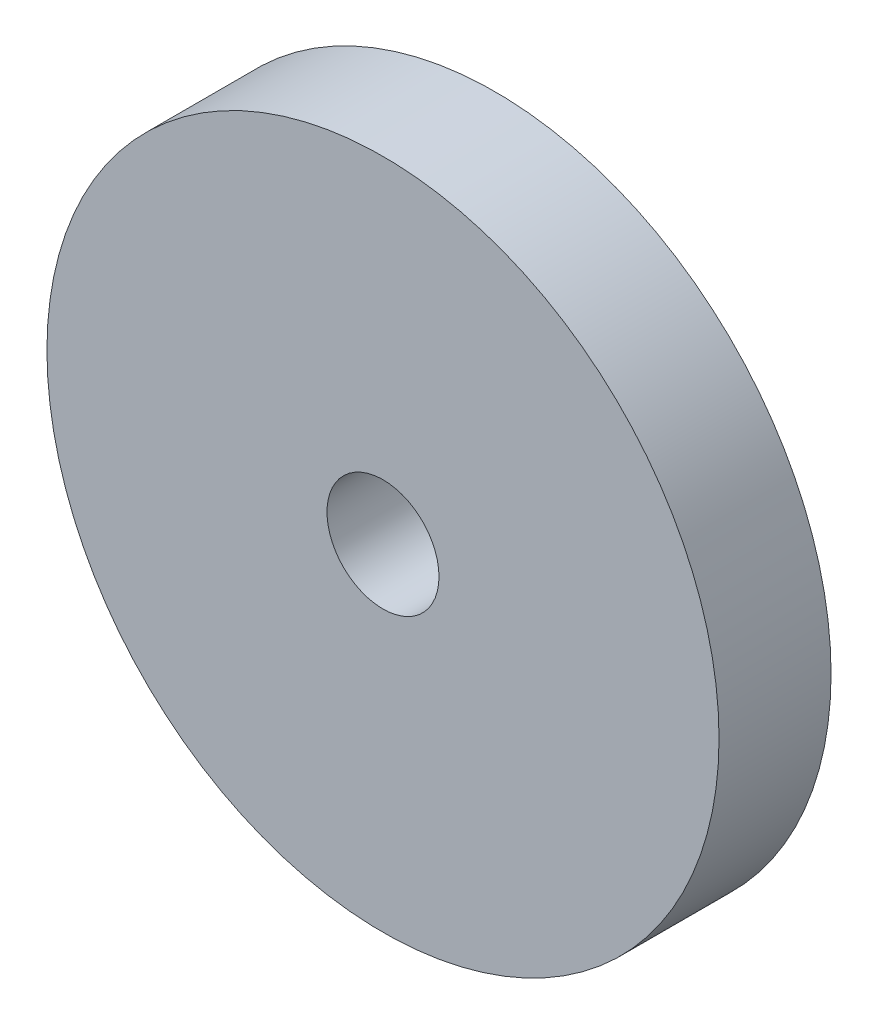
ISO-10303-21;
HEADER;
FILE_DESCRIPTION(('STEP AP214'),'2;1');
FILE_NAME('part.step','',(''),(''),'','','');
FILE_SCHEMA(('AUTOMOTIVE_DESIGN { 1 0 10303 214 1 1 1 1 }'));
ENDSEC;
DATA;
#1=APPLICATION_CONTEXT('core data for automotive mechanical design processes');
#2=APPLICATION_PROTOCOL_DEFINITION('international standard','automotive_design',2000,#1);
#3=PRODUCT_CONTEXT('',#1,'mechanical');
#4=PRODUCT('Part','Part','',(#3));
#5=PRODUCT_RELATED_PRODUCT_CATEGORY('part','',(#4));
#6=PRODUCT_DEFINITION_FORMATION('','',#4);
#7=PRODUCT_DEFINITION_CONTEXT('part definition',#1,'design');
#8=PRODUCT_DEFINITION('design','',#6,#7);
#9=PRODUCT_DEFINITION_SHAPE('','',#8);
#10=(LENGTH_UNIT() NAMED_UNIT(*) SI_UNIT(.MILLI.,.METRE.));
#11=(NAMED_UNIT(*) PLANE_ANGLE_UNIT() SI_UNIT($,.RADIAN.));
#12=(NAMED_UNIT(*) SI_UNIT($,.STERADIAN.) SOLID_ANGLE_UNIT());
#13=UNCERTAINTY_MEASURE_WITH_UNIT(LENGTH_MEASURE(1.E-05),#10,'distance_accuracy_value','');
#14=(GEOMETRIC_REPRESENTATION_CONTEXT(3) GLOBAL_UNCERTAINTY_ASSIGNED_CONTEXT((#13)) GLOBAL_UNIT_ASSIGNED_CONTEXT((#10,
#11,#12)) REPRESENTATION_CONTEXT('',''));
#15=CARTESIAN_POINT('',(0.,0.,0.));
#16=DIRECTION('',(0.,0.,1.));
#17=DIRECTION('',(1.,0.,0.));
#18=AXIS2_PLACEMENT_3D('',#15,#16,#17);
#19=CARTESIAN_POINT('',(0.,0.,20.));
#20=DIRECTION('',(0.,0.,-1.));
#21=DIRECTION('',(-1.,0.,0.));
#22=AXIS2_PLACEMENT_3D('',#19,#20,#21);
#23=CYLINDRICAL_SURFACE('',#22,60.);
#24=CARTESIAN_POINT('',(0.,0.,20.));
#25=DIRECTION('',(0.,0.,1.));
#26=DIRECTION('',(1.,0.,0.));
#27=AXIS2_PLACEMENT_3D('',#24,#25,#26);
#28=CIRCLE('',#27,60.);
#29=CARTESIAN_POINT('',(60.,0.,20.));
#30=VERTEX_POINT('',#29);
#31=EDGE_CURVE('E10',#30,#30,#28,.T.);
#32=ORIENTED_EDGE('',*,*,#31,.F.);
#33=EDGE_LOOP('',(#32));
#34=FACE_BOUND('',#33,.T.);
#35=CARTESIAN_POINT('',(0.,0.,0.));
#36=DIRECTION('',(0.,0.,1.));
#37=DIRECTION('',(1.,0.,0.));
#38=AXIS2_PLACEMENT_3D('',#35,#36,#37);
#39=CIRCLE('',#38,60.);
#40=CARTESIAN_POINT('',(60.,0.,0.));
#41=VERTEX_POINT('',#40);
#42=EDGE_CURVE('E34',#41,#41,#39,.T.);
#43=ORIENTED_EDGE('',*,*,#42,.T.);
#44=EDGE_LOOP('',(#43));
#45=FACE_BOUND('',#44,.T.);
#46=ADVANCED_FACE('F31',(#34,#45),#23,.T.);
#47=CARTESIAN_POINT('',(0.,0.,20.));
#48=DIRECTION('',(0.,0.,1.));
#49=DIRECTION('',(1.,0.,0.));
#50=AXIS2_PLACEMENT_3D('',#47,#48,#49);
#51=PLANE('',#50);
#52=CARTESIAN_POINT('',(0.,0.,20.));
#53=DIRECTION('',(0.,0.,1.));
#54=DIRECTION('',(1.,0.,0.));
#55=AXIS2_PLACEMENT_3D('',#52,#53,#54);
#56=CIRCLE('',#55,10.);
#57=CARTESIAN_POINT('',(10.,0.,20.));
#58=VERTEX_POINT('',#57);
#59=EDGE_CURVE('E43',#58,#58,#56,.T.);
#60=ORIENTED_EDGE('',*,*,#59,.F.);
#61=EDGE_LOOP('',(#60));
#62=FACE_BOUND('',#61,.T.);
#63=ORIENTED_EDGE('',*,*,#31,.T.);
#64=EDGE_LOOP('',(#63));
#65=FACE_BOUND('',#64,.T.);
#66=ADVANCED_FACE('F58',(#62,#65),#51,.T.);
#67=CARTESIAN_POINT('',(0.,0.,0.));
#68=DIRECTION('',(0.,0.,1.));
#69=DIRECTION('',(1.,0.,0.));
#70=AXIS2_PLACEMENT_3D('',#67,#68,#69);
#71=PLANE('',#70);
#72=CARTESIAN_POINT('',(0.,0.,0.));
#73=DIRECTION('',(0.,0.,1.));
#74=DIRECTION('',(1.,0.,0.));
#75=AXIS2_PLACEMENT_3D('',#72,#73,#74);
#76=CIRCLE('',#75,10.);
#77=CARTESIAN_POINT('',(10.,0.,0.));
#78=VERTEX_POINT('',#77);
#79=EDGE_CURVE('E41',#78,#78,#76,.T.);
#80=ORIENTED_EDGE('',*,*,#79,.T.);
#81=EDGE_LOOP('',(#80));
#82=FACE_BOUND('',#81,.T.);
#83=ORIENTED_EDGE('',*,*,#42,.F.);
#84=EDGE_LOOP('',(#83));
#85=FACE_BOUND('',#84,.T.);
#86=ADVANCED_FACE('F49',(#82,#85),#71,.F.);
#87=CARTESIAN_POINT('',(0.,0.,0.));
#88=DIRECTION('',(0.,0.,1.));
#89=DIRECTION('',(1.,0.,0.));
#90=AXIS2_PLACEMENT_3D('',#87,#88,#89);
#91=CYLINDRICAL_SURFACE('',#90,10.);
#92=ORIENTED_EDGE('',*,*,#79,.F.);
#93=EDGE_LOOP('',(#92));
#94=FACE_BOUND('',#93,.T.);
#95=ORIENTED_EDGE('',*,*,#59,.T.);
#96=EDGE_LOOP('',(#95));
#97=FACE_BOUND('',#96,.T.);
#98=ADVANCED_FACE('F52',(#94,#97),#91,.F.);
#99=CLOSED_SHELL('',(#46,#66,#86,#98));
#100=MANIFOLD_SOLID_BREP('B2',#99);
#101=ADVANCED_BREP_SHAPE_REPRESENTATION('',(#18,#100),#14);
#102=SHAPE_DEFINITION_REPRESENTATION(#9,#101);
ENDSEC;
END-ISO-10303-21;
